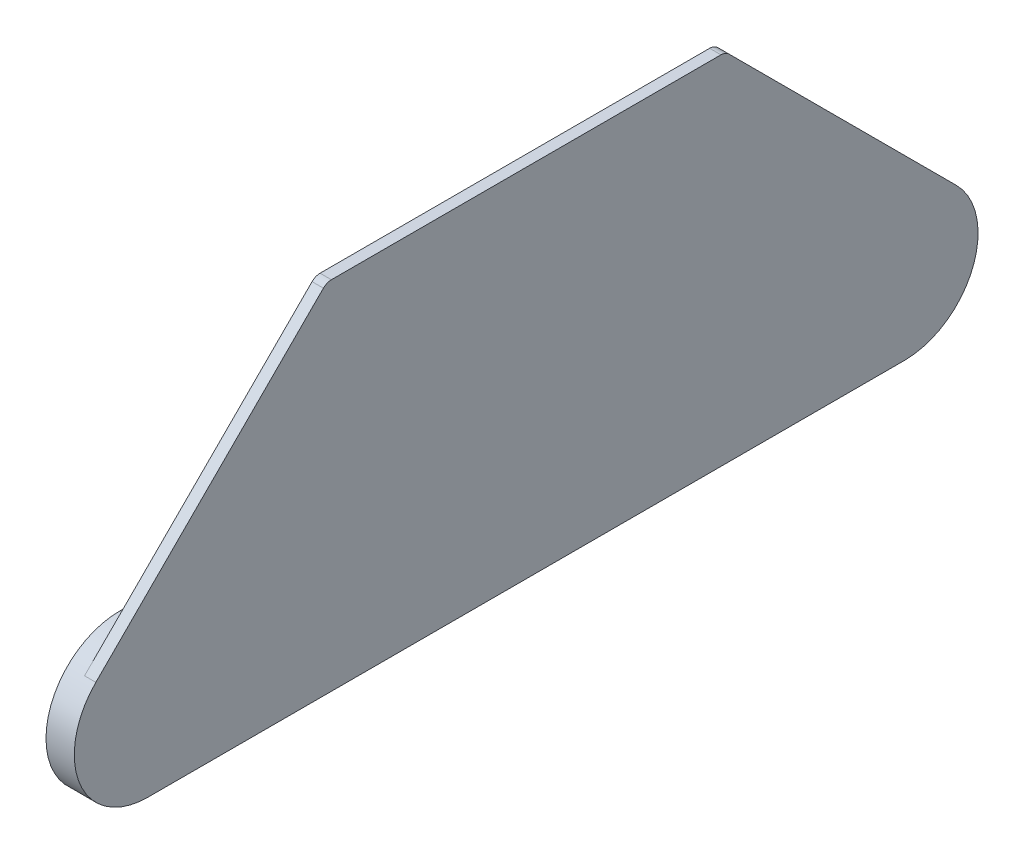
ISO-10303-21;
HEADER;
FILE_DESCRIPTION(('STEP AP214'),'2;1');
FILE_NAME('part.step','',(''),(''),'','','');
FILE_SCHEMA(('AUTOMOTIVE_DESIGN { 1 0 10303 214 1 1 1 1 }'));
ENDSEC;
DATA;
#1=APPLICATION_CONTEXT('core data for automotive mechanical design processes');
#2=APPLICATION_PROTOCOL_DEFINITION('international standard','automotive_design',2000,#1);
#3=PRODUCT_CONTEXT('',#1,'mechanical');
#4=PRODUCT('Part','Part','',(#3));
#5=PRODUCT_RELATED_PRODUCT_CATEGORY('part','',(#4));
#6=PRODUCT_DEFINITION_FORMATION('','',#4);
#7=PRODUCT_DEFINITION_CONTEXT('part definition',#1,'design');
#8=PRODUCT_DEFINITION('design','',#6,#7);
#9=PRODUCT_DEFINITION_SHAPE('','',#8);
#10=(LENGTH_UNIT() NAMED_UNIT(*) SI_UNIT(.MILLI.,.METRE.));
#11=(NAMED_UNIT(*) PLANE_ANGLE_UNIT() SI_UNIT($,.RADIAN.));
#12=(NAMED_UNIT(*) SI_UNIT($,.STERADIAN.) SOLID_ANGLE_UNIT());
#13=UNCERTAINTY_MEASURE_WITH_UNIT(LENGTH_MEASURE(1.E-05),#10,'distance_accuracy_value','');
#14=(GEOMETRIC_REPRESENTATION_CONTEXT(3) GLOBAL_UNCERTAINTY_ASSIGNED_CONTEXT((#13)) GLOBAL_UNIT_ASSIGNED_CONTEXT((#10,
#11,#12)) REPRESENTATION_CONTEXT('',''));
#15=CARTESIAN_POINT('',(0.,0.,0.));
#16=DIRECTION('',(0.,0.,1.));
#17=DIRECTION('',(1.,0.,0.));
#18=AXIS2_PLACEMENT_3D('',#15,#16,#17);
#19=CARTESIAN_POINT('',(-2.54,0.,0.));
#20=DIRECTION('',(1.,0.,0.));
#21=DIRECTION('',(0.,0.,-1.));
#22=AXIS2_PLACEMENT_3D('',#19,#20,#21);
#23=PLANE('',#22);
#24=DIRECTION('',(0.,0.,-1.));
#25=VECTOR('',#24,1.);
#26=CARTESIAN_POINT('',(-2.54,16.51,0.));
#27=LINE('',#26,#25);
#28=CARTESIAN_POINT('',(-2.54,16.51,56.842949223809));
#29=VERTEX_POINT('',#28);
#30=CARTESIAN_POINT('',(-2.54,16.51,1.30680579649923));
#31=VERTEX_POINT('',#30);
#32=EDGE_CURVE('E437',#29,#31,#27,.T.);
#33=ORIENTED_EDGE('',*,*,#32,.F.);
#34=DIRECTION('',(0.,0.554700196225229,-0.832050294337844));
#35=VECTOR('',#34,1.);
#36=CARTESIAN_POINT('',(-2.54,37.6652073340657,25.1101382227105));
#37=LINE('',#36,#35);
#38=CARTESIAN_POINT('',(-2.54,41.5512997013233,19.2809996718241));
#39=VERTEX_POINT('',#38);
#40=EDGE_CURVE('E414',#29,#39,#37,.T.);
#41=ORIENTED_EDGE('',*,*,#40,.T.);
#42=DIRECTION('',(0.,0.554700196225229,0.832050294337844));
#43=VECTOR('',#42,1.);
#44=CARTESIAN_POINT('',(-2.54,19.8673614831511,-13.2449076554341));
#45=LINE('',#44,#43);
#46=CARTESIAN_POINT('',(-2.54,29.6365922523819,1.40893849841209));
#47=VERTEX_POINT('',#46);
#48=EDGE_CURVE('E460',#47,#39,#45,.T.);
#49=ORIENTED_EDGE('',*,*,#48,.F.);
#50=CARTESIAN_POINT('',(-2.54,31.75,0.));
#51=DIRECTION('',(1.,0.,0.));
#52=DIRECTION('',(0.,0.,-1.));
#53=AXIS2_PLACEMENT_3D('',#50,#51,#52);
#54=CIRCLE('',#53,2.54);
#55=CARTESIAN_POINT('',(-2.54,29.5719599153744,1.30680579649925));
#56=VERTEX_POINT('',#55);
#57=EDGE_CURVE('E459',#47,#56,#54,.T.);
#58=ORIENTED_EDGE('',*,*,#57,.T.);
#59=DIRECTION('',(0.,-1.,0.));
#60=VECTOR('',#59,1.);
#61=CARTESIAN_POINT('',(-2.54,0.,1.30680579649925));
#62=LINE('',#61,#60);
#63=EDGE_CURVE('E373',#56,#31,#62,.T.);
#64=ORIENTED_EDGE('',*,*,#63,.T.);
#65=EDGE_LOOP('',(#33,#41,#49,#58,#64));
#66=FACE_BOUND('',#65,.T.);
#67=ADVANCED_FACE('F47',(#66),#23,.F.);
#68=CARTESIAN_POINT('',(-6.35,16.51,84.9253895647883));
#69=DIRECTION('',(0.,-1.,0.));
#70=DIRECTION('',(0.,0.,-1.));
#71=AXIS2_PLACEMENT_3D('',#68,#69,#70);
#72=PLANE('',#71);
#73=DIRECTION('',(0.95300940526024,0.,0.30294070952172));
#74=VECTOR('',#73,1.);
#75=CARTESIAN_POINT('',(0.746897105379903,16.51,62.5995367592369));
#76=LINE('',#75,#74);
#77=CARTESIAN_POINT('',(-6.35,16.51,60.3435894069447));
#78=VERTEX_POINT('',#77);
#79=CARTESIAN_POINT('',(-2.54,16.51,61.5547045301606));
#80=VERTEX_POINT('',#79);
#81=EDGE_CURVE('E241',#78,#80,#76,.T.);
#82=ORIENTED_EDGE('',*,*,#81,.F.);
#83=DIRECTION('',(0.,0.,-1.));
#84=VECTOR('',#83,1.);
#85=CARTESIAN_POINT('',(-6.35,16.51,84.9253895647883));
#86=LINE('',#85,#84);
#87=CARTESIAN_POINT('',(-6.35,16.51,84.9253895647883));
#88=VERTEX_POINT('',#87);
#89=EDGE_CURVE('E254',#88,#78,#86,.T.);
#90=ORIENTED_EDGE('',*,*,#89,.F.);
#91=DIRECTION('',(1.,0.,0.));
#92=VECTOR('',#91,1.);
#93=CARTESIAN_POINT('',(-6.35,16.51,84.9253895647883));
#94=LINE('',#93,#92);
#95=CARTESIAN_POINT('',(-2.54,16.51,84.9253895647883));
#96=VERTEX_POINT('',#95);
#97=EDGE_CURVE('E286',#88,#96,#94,.T.);
#98=ORIENTED_EDGE('',*,*,#97,.T.);
#99=EDGE_CURVE('E257',#96,#80,#27,.T.);
#100=ORIENTED_EDGE('',*,*,#99,.T.);
#101=EDGE_LOOP('',(#82,#90,#98,#100));
#102=FACE_BOUND('',#101,.T.);
#103=ADVANCED_FACE('F252',(#102),#72,.F.);
#104=CARTESIAN_POINT('',(-6.35,19.8673614831511,-13.2449076554341));
#105=DIRECTION('',(0.,0.832050294337844,-0.554700196225229));
#106=DIRECTION('',(0.,0.554700196225229,0.832050294337844));
#107=AXIS2_PLACEMENT_3D('',#104,#105,#106);
#108=PLANE('',#107);
#109=DIRECTION('',(-0.982240087996689,-0.104077500017655,-0.156116250026482));
#110=VECTOR('',#109,1.);
#111=CARTESIAN_POINT('',(-13.9420598710757,41.9137301975197,19.8246454161189));
#112=LINE('',#111,#110);
#113=CARTESIAN_POINT('',(-2.54,43.1218848034405,21.636877325));
#114=VERTEX_POINT('',#113);
#115=CARTESIAN_POINT('',(-6.35,42.7181797623685,21.0313197633919));
#116=VERTEX_POINT('',#115);
#117=EDGE_CURVE('E244',#114,#116,#112,.T.);
#118=ORIENTED_EDGE('',*,*,#117,.F.);
#119=CARTESIAN_POINT('',(-2.54,55.0365922523818,39.508938498412));
#120=VERTEX_POINT('',#119);
#121=EDGE_CURVE('E467',#114,#120,#45,.T.);
#122=ORIENTED_EDGE('',*,*,#121,.T.);
#123=DIRECTION('',(1.,0.,0.));
#124=VECTOR('',#123,1.);
#125=CARTESIAN_POINT('',(-6.35,55.0365922523818,39.508938498412));
#126=LINE('',#125,#124);
#127=CARTESIAN_POINT('',(-6.35,55.0365922523818,39.508938498412));
#128=VERTEX_POINT('',#127);
#129=EDGE_CURVE('E293',#128,#120,#126,.T.);
#130=ORIENTED_EDGE('',*,*,#129,.F.);
#131=DIRECTION('',(0.,0.554700196225229,0.832050294337844));
#132=VECTOR('',#131,1.);
#133=CARTESIAN_POINT('',(-6.35,19.8673614831511,-13.2449076554341));
#134=LINE('',#133,#132);
#135=EDGE_CURVE('E337',#116,#128,#134,.T.);
#136=ORIENTED_EDGE('',*,*,#135,.F.);
#137=EDGE_LOOP('',(#118,#122,#130,#136));
#138=FACE_BOUND('',#137,.T.);
#139=ADVANCED_FACE('F584',(#138),#108,.F.);
#140=DIRECTION('',(0.,-1.,0.));
#141=VECTOR('',#140,1.);
#142=CARTESIAN_POINT('',(-2.54,0.,-1.30680579649925));
#143=LINE('',#142,#141);
#144=CARTESIAN_POINT('',(-2.54,29.5719599153744,-1.30680579649925));
#145=VERTEX_POINT('',#144);
#146=CARTESIAN_POINT('',(-2.54,16.51,-1.30680579649925));
#147=VERTEX_POINT('',#146);
#148=EDGE_CURVE('E383',#145,#147,#143,.T.);
#149=ORIENTED_EDGE('',*,*,#148,.F.);
#150=CARTESIAN_POINT('',(-2.54,29.6365922523819,-1.40893849841209));
#151=VERTEX_POINT('',#150);
#152=EDGE_CURVE('E452',#145,#151,#54,.T.);
#153=ORIENTED_EDGE('',*,*,#152,.T.);
#154=DIRECTION('',(0.,-0.554700196225229,0.832050294337844));
#155=VECTOR('',#154,1.);
#156=CARTESIAN_POINT('',(-2.54,19.8673614831511,13.2449076554341));
#157=LINE('',#156,#155);
#158=CARTESIAN_POINT('',(-2.54,41.5512997013232,-19.2809996718241));
#159=VERTEX_POINT('',#158);
#160=EDGE_CURVE('E465',#159,#151,#157,.T.);
#161=ORIENTED_EDGE('',*,*,#160,.F.);
#162=DIRECTION('',(0.,-0.554700196225229,-0.832050294337844));
#163=VECTOR('',#162,1.);
#164=CARTESIAN_POINT('',(-2.54,37.6652073340657,-25.1101382227105));
#165=LINE('',#164,#163);
#166=CARTESIAN_POINT('',(-2.54,16.51,-56.842949223809));
#167=VERTEX_POINT('',#166);
#168=EDGE_CURVE('E345',#159,#167,#165,.T.);
#169=ORIENTED_EDGE('',*,*,#168,.T.);
#170=EDGE_CURVE('E454',#147,#167,#27,.T.);
#171=ORIENTED_EDGE('',*,*,#170,.F.);
#172=EDGE_LOOP('',(#149,#153,#161,#169,#171));
#173=FACE_BOUND('',#172,.T.);
#174=ADVANCED_FACE('F450',(#173),#23,.F.);
#175=DIRECTION('',(-0.984807753012208,0.,0.173648177666931));
#176=VECTOR('',#175,1.);
#177=CARTESIAN_POINT('',(-20.9816883509745,16.51,1.94496142959456));
#178=LINE('',#177,#176);
#179=CARTESIAN_POINT('',(-6.35,16.51,-0.634999999999997));
#180=VERTEX_POINT('',#179);
#181=EDGE_CURVE('E73',#147,#180,#178,.T.);
#182=ORIENTED_EDGE('',*,*,#181,.F.);
#183=ORIENTED_EDGE('',*,*,#170,.T.);
#184=DIRECTION('',(-0.95300940526024,0.,-0.30294070952172));
#185=VECTOR('',#184,1.);
#186=CARTESIAN_POINT('',(34.9289326282017,16.51,-44.9324004162562));
#187=LINE('',#186,#185);
#188=CARTESIAN_POINT('',(-6.35,16.51,-58.054064347025));
#189=VERTEX_POINT('',#188);
#190=EDGE_CURVE('E291',#167,#189,#187,.T.);
#191=ORIENTED_EDGE('',*,*,#190,.T.);
#192=EDGE_CURVE('E274',#180,#189,#86,.T.);
#193=ORIENTED_EDGE('',*,*,#192,.F.);
#194=EDGE_LOOP('',(#182,#183,#191,#193));
#195=FACE_BOUND('',#194,.T.);
#196=ADVANCED_FACE('F586',(#195),#72,.F.);
#197=CARTESIAN_POINT('',(-6.35,31.75,0.));
#198=DIRECTION('',(1.,0.,0.));
#199=DIRECTION('',(0.,0.,-1.));
#200=AXIS2_PLACEMENT_3D('',#197,#198,#199);
#201=CYLINDRICAL_SURFACE('',#200,2.54);
#202=ORIENTED_EDGE('',*,*,#152,.F.);
#203=CARTESIAN_POINT('',(-9.95126395545724,31.75,0.));
#204=DIRECTION('',(0.173648177666931,0.,0.984807753012208));
#205=DIRECTION('',(0.984807753012208,0.,-0.173648177666931));
#206=AXIS2_PLACEMENT_3D('',#203,#204,#205);
#207=ELLIPSE('',#206,14.6272770271848,2.54);
#208=CARTESIAN_POINT('',(-6.35,29.2906555751583,-0.635));
#209=VERTEX_POINT('',#208);
#210=EDGE_CURVE('E387',#145,#209,#207,.F.);
#211=ORIENTED_EDGE('',*,*,#210,.T.);
#212=CARTESIAN_POINT('',(-6.35,31.75,0.));
#213=DIRECTION('',(1.,0.,0.));
#214=DIRECTION('',(0.,0.,-1.));
#215=AXIS2_PLACEMENT_3D('',#212,#213,#214);
#216=CIRCLE('',#215,2.54);
#217=CARTESIAN_POINT('',(-6.35,29.6365922523819,-1.40893849841209));
#218=VERTEX_POINT('',#217);
#219=EDGE_CURVE('E332',#209,#218,#216,.T.);
#220=ORIENTED_EDGE('',*,*,#219,.T.);
#221=DIRECTION('',(1.,0.,0.));
#222=VECTOR('',#221,1.);
#223=CARTESIAN_POINT('',(-6.35,29.6365922523819,-1.40893849841209));
#224=LINE('',#223,#222);
#225=EDGE_CURVE('E302',#218,#151,#224,.T.);
#226=ORIENTED_EDGE('',*,*,#225,.T.);
#227=EDGE_LOOP('',(#202,#211,#220,#226));
#228=FACE_BOUND('',#227,.T.);
#229=ADVANCED_FACE('F456',(#228),#201,.T.);
#230=DIRECTION('',(-0.95300940526024,0.,0.30294070952172));
#231=VECTOR('',#230,1.);
#232=CARTESIAN_POINT('',(-48.2899307514516,16.51,-47.0118087246049));
#233=LINE('',#232,#231);
#234=CARTESIAN_POINT('',(-2.54,16.51,-61.5547045301606));
#235=VERTEX_POINT('',#234);
#236=CARTESIAN_POINT('',(-6.35,16.51,-60.3435894069446));
#237=VERTEX_POINT('',#236);
#238=EDGE_CURVE('E353',#235,#237,#233,.T.);
#239=ORIENTED_EDGE('',*,*,#238,.F.);
#240=CARTESIAN_POINT('',(-2.54,16.51,-84.9253895647883));
#241=VERTEX_POINT('',#240);
#242=EDGE_CURVE('E623',#235,#241,#27,.T.);
#243=ORIENTED_EDGE('',*,*,#242,.T.);
#244=DIRECTION('',(1.,0.,0.));
#245=VECTOR('',#244,1.);
#246=CARTESIAN_POINT('',(-6.35,16.51,-84.9253895647883));
#247=LINE('',#246,#245);
#248=CARTESIAN_POINT('',(-6.35,16.51,-84.9253895647883));
#249=VERTEX_POINT('',#248);
#250=EDGE_CURVE('E278',#249,#241,#247,.T.);
#251=ORIENTED_EDGE('',*,*,#250,.F.);
#252=EDGE_CURVE('E269',#237,#249,#86,.T.);
#253=ORIENTED_EDGE('',*,*,#252,.F.);
#254=EDGE_LOOP('',(#239,#243,#251,#253));
#255=FACE_BOUND('',#254,.T.);
#256=ADVANCED_FACE('F597',(#255),#72,.F.);
#257=CARTESIAN_POINT('',(-6.35,19.8673614831511,13.2449076554341));
#258=DIRECTION('',(0.,0.832050294337844,0.554700196225229));
#259=DIRECTION('',(0.,-0.554700196225229,0.832050294337844));
#260=AXIS2_PLACEMENT_3D('',#257,#258,#259);
#261=PLANE('',#260);
#262=DIRECTION('',(0.982240087996689,0.104077500017655,-0.156116250026482));
#263=VECTOR('',#262,1.);
#264=CARTESIAN_POINT('',(-13.9420598710757,41.9137301975197,-19.8246454161189));
#265=LINE('',#264,#263);
#266=CARTESIAN_POINT('',(-6.35,42.7181797623685,-21.031319763392));
#267=VERTEX_POINT('',#266);
#268=CARTESIAN_POINT('',(-2.54,43.1218848034404,-21.6368773249999));
#269=VERTEX_POINT('',#268);
#270=EDGE_CURVE('E359',#267,#269,#265,.T.);
#271=ORIENTED_EDGE('',*,*,#270,.F.);
#272=DIRECTION('',(0.,-0.554700196225229,0.832050294337844));
#273=VECTOR('',#272,1.);
#274=CARTESIAN_POINT('',(-6.35,19.8673614831511,13.2449076554341));
#275=LINE('',#274,#273);
#276=CARTESIAN_POINT('',(-6.35,55.0365922523818,-39.508938498412));
#277=VERTEX_POINT('',#276);
#278=EDGE_CURVE('E324',#277,#267,#275,.T.);
#279=ORIENTED_EDGE('',*,*,#278,.F.);
#280=DIRECTION('',(1.,0.,0.));
#281=VECTOR('',#280,1.);
#282=CARTESIAN_POINT('',(-6.35,55.0365922523818,-39.508938498412));
#283=LINE('',#282,#281);
#284=CARTESIAN_POINT('',(-2.54,55.0365922523818,-39.508938498412));
#285=VERTEX_POINT('',#284);
#286=EDGE_CURVE('E306',#277,#285,#283,.T.);
#287=ORIENTED_EDGE('',*,*,#286,.T.);
#288=EDGE_CURVE('E471',#285,#269,#157,.T.);
#289=ORIENTED_EDGE('',*,*,#288,.T.);
#290=EDGE_LOOP('',(#271,#279,#287,#289));
#291=FACE_BOUND('',#290,.T.);
#292=ADVANCED_FACE('F589',(#291),#261,.F.);
#293=CARTESIAN_POINT('',(-2.54,57.15,-38.1));
#294=DIRECTION('',(1.,0.,0.));
#295=DIRECTION('',(0.,0.,-1.));
#296=AXIS2_PLACEMENT_3D('',#293,#294,#295);
#297=CIRCLE('',#296,2.54);
#298=CARTESIAN_POINT('',(-2.54,59.69,-38.0999999999999));
#299=VERTEX_POINT('',#298);
#300=EDGE_CURVE('E475',#299,#285,#297,.F.);
#301=ORIENTED_EDGE('',*,*,#300,.F.);
#302=DIRECTION('',(0.,0.,-1.));
#303=VECTOR('',#302,1.);
#304=CARTESIAN_POINT('',(-2.54,59.69,0.));
#305=LINE('',#304,#303);
#306=CARTESIAN_POINT('',(-2.54,59.69,38.0999999999999));
#307=VERTEX_POINT('',#306);
#308=EDGE_CURVE('E479',#307,#299,#305,.T.);
#309=ORIENTED_EDGE('',*,*,#308,.F.);
#310=CARTESIAN_POINT('',(-2.54,57.15,38.1));
#311=DIRECTION('',(1.,0.,0.));
#312=DIRECTION('',(0.,0.,-1.));
#313=AXIS2_PLACEMENT_3D('',#310,#311,#312);
#314=CIRCLE('',#313,2.54);
#315=EDGE_CURVE('E482',#120,#307,#314,.F.);
#316=ORIENTED_EDGE('',*,*,#315,.F.);
#317=ORIENTED_EDGE('',*,*,#121,.F.);
#318=DIRECTION('',(0.,0.554700196225229,-0.832050294337844));
#319=VECTOR('',#318,1.);
#320=CARTESIAN_POINT('',(-2.54,39.8398636293049,26.5599090862033));
#321=LINE('',#320,#319);
#322=EDGE_CURVE('E260',#80,#114,#321,.T.);
#323=ORIENTED_EDGE('',*,*,#322,.F.);
#324=ORIENTED_EDGE('',*,*,#99,.F.);
#325=CARTESIAN_POINT('',(-2.54,0.,84.9253895647883));
#326=DIRECTION('',(1.,0.,0.));
#327=DIRECTION('',(0.,0.,-1.));
#328=AXIS2_PLACEMENT_3D('',#325,#326,#327);
#329=CIRCLE('',#328,16.51);
#330=CARTESIAN_POINT('',(-2.54,11.6743329573899,96.5997225221782));
#331=VERTEX_POINT('',#330);
#332=EDGE_CURVE('E619',#96,#331,#329,.T.);
#333=ORIENTED_EDGE('',*,*,#332,.T.);
#334=DIRECTION('',(0.,0.707106781186549,-0.707106781186546));
#335=VECTOR('',#334,1.);
#336=CARTESIAN_POINT('',(-2.54,54.137027739784,54.1370277397842));
#337=LINE('',#336,#335);
#338=CARTESIAN_POINT('',(-2.54,62.7560512242138,45.5180042553545));
#339=VERTEX_POINT('',#338);
#340=EDGE_CURVE('E487',#331,#339,#337,.T.);
#341=ORIENTED_EDGE('',*,*,#340,.T.);
#342=CARTESIAN_POINT('',(-2.54,60.96,43.7219530311406));
#343=DIRECTION('',(1.,0.,0.));
#344=DIRECTION('',(0.,0.,-1.));
#345=AXIS2_PLACEMENT_3D('',#342,#343,#344);
#346=CIRCLE('',#345,2.54);
#347=CARTESIAN_POINT('',(-2.54,63.5,43.7219530311406));
#348=VERTEX_POINT('',#347);
#349=EDGE_CURVE('E502',#339,#348,#346,.F.);
#350=ORIENTED_EDGE('',*,*,#349,.T.);
#351=DIRECTION('',(0.,0.,-1.));
#352=VECTOR('',#351,1.);
#353=CARTESIAN_POINT('',(-2.54,63.5,0.));
#354=LINE('',#353,#352);
#355=CARTESIAN_POINT('',(-2.54,63.5,-43.7219530311406));
#356=VERTEX_POINT('',#355);
#357=EDGE_CURVE('E499',#348,#356,#354,.T.);
#358=ORIENTED_EDGE('',*,*,#357,.T.);
#359=CARTESIAN_POINT('',(-2.54,60.96,-43.7219530311406));
#360=DIRECTION('',(1.,0.,0.));
#361=DIRECTION('',(0.,0.,-1.));
#362=AXIS2_PLACEMENT_3D('',#359,#360,#361);
#363=CIRCLE('',#362,2.54);
#364=CARTESIAN_POINT('',(-2.54,62.7560512242138,-45.5180042553545));
#365=VERTEX_POINT('',#364);
#366=EDGE_CURVE('E496',#356,#365,#363,.F.);
#367=ORIENTED_EDGE('',*,*,#366,.T.);
#368=DIRECTION('',(0.,-0.707106781186549,-0.707106781186546));
#369=VECTOR('',#368,1.);
#370=CARTESIAN_POINT('',(-2.54,54.1370277397841,-54.1370277397842));
#371=LINE('',#370,#369);
#372=CARTESIAN_POINT('',(-2.54,11.6743329573899,-96.5997225221782));
#373=VERTEX_POINT('',#372);
#374=EDGE_CURVE('E491',#365,#373,#371,.T.);
#375=ORIENTED_EDGE('',*,*,#374,.T.);
#376=CARTESIAN_POINT('',(-2.54,0.,-84.9253895647883));
#377=DIRECTION('',(1.,0.,0.));
#378=DIRECTION('',(0.,0.,-1.));
#379=AXIS2_PLACEMENT_3D('',#376,#377,#378);
#380=CIRCLE('',#379,16.51);
#381=EDGE_CURVE('E318',#373,#241,#380,.T.);
#382=ORIENTED_EDGE('',*,*,#381,.T.);
#383=ORIENTED_EDGE('',*,*,#242,.F.);
#384=DIRECTION('',(0.,-0.554700196225229,-0.832050294337844));
#385=VECTOR('',#384,1.);
#386=CARTESIAN_POINT('',(-2.54,39.8398636293049,-26.5599090862033));
#387=LINE('',#386,#385);
#388=EDGE_CURVE('E356',#269,#235,#387,.T.);
#389=ORIENTED_EDGE('',*,*,#388,.F.);
#390=ORIENTED_EDGE('',*,*,#288,.F.);
#391=EDGE_LOOP('',(#301,#309,#316,#317,#323,#324,#333,#341,#350,#358,#367,#375,#382,#383,#389,#390));
#392=FACE_BOUND('',#391,.T.);
#393=ADVANCED_FACE('F579',(#392),#23,.F.);
#394=CARTESIAN_POINT('',(-2.54,54.137027739784,54.1370277397842));
#395=DIRECTION('',(0.,-0.707106781186546,-0.707106781186549));
#396=DIRECTION('',(0.,0.707106781186549,-0.707106781186546));
#397=AXIS2_PLACEMENT_3D('',#394,#395,#396);
#398=PLANE('',#397);
#399=DIRECTION('',(0.,0.707106781186549,-0.707106781186546));
#400=VECTOR('',#399,1.);
#401=CARTESIAN_POINT('',(0.,54.137027739784,54.1370277397842));
#402=LINE('',#401,#400);
#403=CARTESIAN_POINT('',(0.,11.6743329573899,96.5997225221782));
#404=VERTEX_POINT('',#403);
#405=CARTESIAN_POINT('',(0.,62.7560512242138,45.5180042553545));
#406=VERTEX_POINT('',#405);
#407=EDGE_CURVE('E486',#404,#406,#402,.T.);
#408=ORIENTED_EDGE('',*,*,#407,.T.);
#409=DIRECTION('',(1.,0.,0.));
#410=VECTOR('',#409,1.);
#411=CARTESIAN_POINT('',(-2.54,62.7560512242138,45.5180042553545));
#412=LINE('',#411,#410);
#413=EDGE_CURVE('E11',#339,#406,#412,.T.);
#414=ORIENTED_EDGE('',*,*,#413,.F.);
#415=ORIENTED_EDGE('',*,*,#340,.F.);
#416=DIRECTION('',(1.,0.,0.));
#417=VECTOR('',#416,1.);
#418=CARTESIAN_POINT('',(-2.54,11.6743329573899,96.5997225221782));
#419=LINE('',#418,#417);
#420=EDGE_CURVE('E51',#331,#404,#419,.T.);
#421=ORIENTED_EDGE('',*,*,#420,.T.);
#422=EDGE_LOOP('',(#408,#414,#415,#421));
#423=FACE_BOUND('',#422,.T.);
#424=ADVANCED_FACE('F49',(#423),#398,.F.);
#425=CARTESIAN_POINT('',(-2.54,60.96,43.7219530311406));
#426=DIRECTION('',(1.,0.,0.));
#427=DIRECTION('',(0.,0.,-1.));
#428=AXIS2_PLACEMENT_3D('',#425,#426,#427);
#429=CYLINDRICAL_SURFACE('',#428,2.54);
#430=CARTESIAN_POINT('',(0.,60.96,43.7219530311406));
#431=DIRECTION('',(1.,0.,0.));
#432=DIRECTION('',(0.,0.,-1.));
#433=AXIS2_PLACEMENT_3D('',#430,#431,#432);
#434=CIRCLE('',#433,2.54);
#435=CARTESIAN_POINT('',(0.,63.5,43.7219530311406));
#436=VERTEX_POINT('',#435);
#437=EDGE_CURVE('E492',#406,#436,#434,.F.);
#438=ORIENTED_EDGE('',*,*,#437,.T.);
#439=DIRECTION('',(1.,0.,0.));
#440=VECTOR('',#439,1.);
#441=CARTESIAN_POINT('',(-2.54,63.5,43.7219530311406));
#442=LINE('',#441,#440);
#443=EDGE_CURVE('E57',#348,#436,#442,.T.);
#444=ORIENTED_EDGE('',*,*,#443,.F.);
#445=ORIENTED_EDGE('',*,*,#349,.F.);
#446=ORIENTED_EDGE('',*,*,#413,.T.);
#447=EDGE_LOOP('',(#438,#444,#445,#446));
#448=FACE_BOUND('',#447,.T.);
#449=ADVANCED_FACE('F595',(#448),#429,.T.);
#450=CARTESIAN_POINT('',(-2.54,63.5,0.));
#451=DIRECTION('',(0.,-1.,0.));
#452=DIRECTION('',(0.,0.,-1.));
#453=AXIS2_PLACEMENT_3D('',#450,#451,#452);
#454=PLANE('',#453);
#455=DIRECTION('',(1.,0.,0.));
#456=VECTOR('',#455,1.);
#457=CARTESIAN_POINT('',(-2.54,63.5,-43.7219530311406));
#458=LINE('',#457,#456);
#459=CARTESIAN_POINT('',(0.,63.5,-43.7219530311406));
#460=VERTEX_POINT('',#459);
#461=EDGE_CURVE('E532',#356,#460,#458,.T.);
#462=ORIENTED_EDGE('',*,*,#461,.F.);
#463=ORIENTED_EDGE('',*,*,#357,.F.);
#464=ORIENTED_EDGE('',*,*,#443,.T.);
#465=DIRECTION('',(0.,0.,-1.));
#466=VECTOR('',#465,1.);
#467=CARTESIAN_POINT('',(0.,63.5,0.));
#468=LINE('',#467,#466);
#469=EDGE_CURVE('E524',#436,#460,#468,.T.);
#470=ORIENTED_EDGE('',*,*,#469,.T.);
#471=EDGE_LOOP('',(#462,#463,#464,#470));
#472=FACE_BOUND('',#471,.T.);
#473=ADVANCED_FACE('F644',(#472),#454,.F.);
#474=CARTESIAN_POINT('',(-2.54,60.96,-43.7219530311406));
#475=DIRECTION('',(1.,0.,0.));
#476=DIRECTION('',(0.,0.,-1.));
#477=AXIS2_PLACEMENT_3D('',#474,#475,#476);
#478=CYLINDRICAL_SURFACE('',#477,2.54);
#479=CARTESIAN_POINT('',(0.,60.96,-43.7219530311406));
#480=DIRECTION('',(1.,0.,0.));
#481=DIRECTION('',(0.,0.,-1.));
#482=AXIS2_PLACEMENT_3D('',#479,#480,#481);
#483=CIRCLE('',#482,2.54);
#484=CARTESIAN_POINT('',(0.,62.7560512242138,-45.5180042553545));
#485=VERTEX_POINT('',#484);
#486=EDGE_CURVE('E521',#460,#485,#483,.F.);
#487=ORIENTED_EDGE('',*,*,#486,.T.);
#488=DIRECTION('',(1.,0.,0.));
#489=VECTOR('',#488,1.);
#490=CARTESIAN_POINT('',(-2.54,62.7560512242138,-45.5180042553545));
#491=LINE('',#490,#489);
#492=EDGE_CURVE('E536',#365,#485,#491,.T.);
#493=ORIENTED_EDGE('',*,*,#492,.F.);
#494=ORIENTED_EDGE('',*,*,#366,.F.);
#495=ORIENTED_EDGE('',*,*,#461,.T.);
#496=EDGE_LOOP('',(#487,#493,#494,#495));
#497=FACE_BOUND('',#496,.T.);
#498=ADVANCED_FACE('F640',(#497),#478,.T.);
#499=CARTESIAN_POINT('',(-2.54,54.1370277397841,-54.1370277397842));
#500=DIRECTION('',(0.,-0.707106781186546,0.707106781186549));
#501=DIRECTION('',(0.,-0.707106781186549,-0.707106781186546));
#502=AXIS2_PLACEMENT_3D('',#499,#500,#501);
#503=PLANE('',#502);
#504=DIRECTION('',(0.,-0.707106781186549,-0.707106781186546));
#505=VECTOR('',#504,1.);
#506=CARTESIAN_POINT('',(0.,54.1370277397841,-54.1370277397842));
#507=LINE('',#506,#505);
#508=CARTESIAN_POINT('',(0.,11.6743329573899,-96.5997225221782));
#509=VERTEX_POINT('',#508);
#510=EDGE_CURVE('E517',#485,#509,#507,.T.);
#511=ORIENTED_EDGE('',*,*,#510,.T.);
#512=DIRECTION('',(1.,0.,0.));
#513=VECTOR('',#512,1.);
#514=CARTESIAN_POINT('',(-2.54,11.6743329573899,-96.5997225221782));
#515=LINE('',#514,#513);
#516=EDGE_CURVE('E540',#373,#509,#515,.T.);
#517=ORIENTED_EDGE('',*,*,#516,.F.);
#518=ORIENTED_EDGE('',*,*,#374,.F.);
#519=ORIENTED_EDGE('',*,*,#492,.T.);
#520=EDGE_LOOP('',(#511,#517,#518,#519));
#521=FACE_BOUND('',#520,.T.);
#522=ADVANCED_FACE('F635',(#521),#503,.F.);
#523=CARTESIAN_POINT('',(-2.54,0.,-84.9253895647883));
#524=DIRECTION('',(1.,0.,0.));
#525=DIRECTION('',(0.,0.,-1.));
#526=AXIS2_PLACEMENT_3D('',#523,#524,#525);
#527=CYLINDRICAL_SURFACE('',#526,16.51);
#528=CARTESIAN_POINT('',(-6.35,0.,-84.9253895647883));
#529=DIRECTION('',(1.,0.,0.));
#530=DIRECTION('',(0.,0.,-1.));
#531=AXIS2_PLACEMENT_3D('',#528,#529,#530);
#532=CIRCLE('',#531,16.51);
#533=CARTESIAN_POINT('',(-6.35,-16.51,-84.9253895647883));
#534=VERTEX_POINT('',#533);
#535=EDGE_CURVE('E266',#534,#249,#532,.T.);
#536=ORIENTED_EDGE('',*,*,#535,.T.);
#537=ORIENTED_EDGE('',*,*,#250,.T.);
#538=ORIENTED_EDGE('',*,*,#381,.F.);
#539=ORIENTED_EDGE('',*,*,#516,.T.);
#540=CARTESIAN_POINT('',(0.,0.,-84.9253895647883));
#541=DIRECTION('',(1.,0.,0.));
#542=DIRECTION('',(0.,0.,-1.));
#543=AXIS2_PLACEMENT_3D('',#540,#541,#542);
#544=CIRCLE('',#543,16.51);
#545=CARTESIAN_POINT('',(0.,-16.51,-84.9253895647883));
#546=VERTEX_POINT('',#545);
#547=EDGE_CURVE('E514',#546,#509,#544,.T.);
#548=ORIENTED_EDGE('',*,*,#547,.F.);
#549=DIRECTION('',(1.,0.,0.));
#550=VECTOR('',#549,1.);
#551=CARTESIAN_POINT('',(-2.54,-16.51,-84.9253895647883));
#552=LINE('',#551,#550);
#553=EDGE_CURVE('E544',#534,#546,#552,.T.);
#554=ORIENTED_EDGE('',*,*,#553,.F.);
#555=EDGE_LOOP('',(#536,#537,#538,#539,#548,#554));
#556=FACE_BOUND('',#555,.T.);
#557=ADVANCED_FACE('F573',(#556),#527,.T.);
#558=CARTESIAN_POINT('',(-2.54,-16.51,0.));
#559=DIRECTION('',(0.,-1.,0.));
#560=DIRECTION('',(0.,0.,-1.));
#561=AXIS2_PLACEMENT_3D('',#558,#559,#560);
#562=PLANE('',#561);
#563=DIRECTION('',(0.,0.,-1.));
#564=VECTOR('',#563,1.);
#565=CARTESIAN_POINT('',(-6.35,-16.51,84.9253895647883));
#566=LINE('',#565,#564);
#567=CARTESIAN_POINT('',(-6.35,-16.51,84.9253895647883));
#568=VERTEX_POINT('',#567);
#569=EDGE_CURVE('E272',#568,#534,#566,.T.);
#570=ORIENTED_EDGE('',*,*,#569,.T.);
#571=ORIENTED_EDGE('',*,*,#553,.T.);
#572=DIRECTION('',(0.,0.,-1.));
#573=VECTOR('',#572,1.);
#574=CARTESIAN_POINT('',(0.,-16.51,0.));
#575=LINE('',#574,#573);
#576=CARTESIAN_POINT('',(0.,-16.51,84.9253895647883));
#577=VERTEX_POINT('',#576);
#578=EDGE_CURVE('E511',#577,#546,#575,.T.);
#579=ORIENTED_EDGE('',*,*,#578,.F.);
#580=DIRECTION('',(1.,0.,0.));
#581=VECTOR('',#580,1.);
#582=CARTESIAN_POINT('',(-2.54,-16.51,84.9253895647883));
#583=LINE('',#582,#581);
#584=EDGE_CURVE('E547',#568,#577,#583,.T.);
#585=ORIENTED_EDGE('',*,*,#584,.F.);
#586=EDGE_LOOP('',(#570,#571,#579,#585));
#587=FACE_BOUND('',#586,.T.);
#588=ADVANCED_FACE('F566',(#587),#562,.T.);
#589=CARTESIAN_POINT('',(-2.54,0.,84.9253895647883));
#590=DIRECTION('',(1.,0.,0.));
#591=DIRECTION('',(0.,0.,-1.));
#592=AXIS2_PLACEMENT_3D('',#589,#590,#591);
#593=CYLINDRICAL_SURFACE('',#592,16.51);
#594=ORIENTED_EDGE('',*,*,#584,.T.);
#595=CARTESIAN_POINT('',(0.,0.,84.9253895647883));
#596=DIRECTION('',(1.,0.,0.));
#597=DIRECTION('',(0.,0.,-1.));
#598=AXIS2_PLACEMENT_3D('',#595,#596,#597);
#599=CIRCLE('',#598,16.51);
#600=EDGE_CURVE('E508',#404,#577,#599,.T.);
#601=ORIENTED_EDGE('',*,*,#600,.F.);
#602=ORIENTED_EDGE('',*,*,#420,.F.);
#603=ORIENTED_EDGE('',*,*,#332,.F.);
#604=ORIENTED_EDGE('',*,*,#97,.F.);
#605=CARTESIAN_POINT('',(-6.35,0.,84.9253895647883));
#606=DIRECTION('',(1.,0.,0.));
#607=DIRECTION('',(0.,0.,-1.));
#608=AXIS2_PLACEMENT_3D('',#605,#606,#607);
#609=CIRCLE('',#608,16.51);
#610=EDGE_CURVE('E264',#88,#568,#609,.T.);
#611=ORIENTED_EDGE('',*,*,#610,.T.);
#612=EDGE_LOOP('',(#594,#601,#602,#603,#604,#611));
#613=FACE_BOUND('',#612,.T.);
#614=ADVANCED_FACE('F564',(#613),#593,.T.);
#615=CARTESIAN_POINT('',(0.,0.,0.));
#616=DIRECTION('',(1.,0.,0.));
#617=DIRECTION('',(0.,0.,-1.));
#618=AXIS2_PLACEMENT_3D('',#615,#616,#617);
#619=PLANE('',#618);
#620=ORIENTED_EDGE('',*,*,#486,.F.);
#621=ORIENTED_EDGE('',*,*,#469,.F.);
#622=ORIENTED_EDGE('',*,*,#437,.F.);
#623=ORIENTED_EDGE('',*,*,#407,.F.);
#624=ORIENTED_EDGE('',*,*,#600,.T.);
#625=ORIENTED_EDGE('',*,*,#578,.T.);
#626=ORIENTED_EDGE('',*,*,#547,.T.);
#627=ORIENTED_EDGE('',*,*,#510,.F.);
#628=EDGE_LOOP('',(#620,#621,#622,#623,#624,#625,#626,#627));
#629=FACE_BOUND('',#628,.T.);
#630=ADVANCED_FACE('F562',(#629),#619,.T.);
#631=CARTESIAN_POINT('',(-6.35,16.51,58.0540643470251));
#632=VERTEX_POINT('',#631);
#633=CARTESIAN_POINT('',(-6.35,16.51,0.634999999999997));
#634=VERTEX_POINT('',#633);
#635=EDGE_CURVE('E267',#632,#634,#86,.T.);
#636=ORIENTED_EDGE('',*,*,#635,.F.);
#637=DIRECTION('',(0.95300940526024,0.,-0.30294070952172));
#638=VECTOR('',#637,1.);
#639=CARTESIAN_POINT('',(-14.1078952286298,16.51,60.5201284508882));
#640=LINE('',#639,#638);
#641=EDGE_CURVE('E397',#632,#29,#640,.T.);
#642=ORIENTED_EDGE('',*,*,#641,.T.);
#643=ORIENTED_EDGE('',*,*,#32,.T.);
#644=DIRECTION('',(-0.984807753012208,0.,-0.173648177666931));
#645=VECTOR('',#644,1.);
#646=CARTESIAN_POINT('',(8.0645055599627,16.51,3.17666624379359));
#647=LINE('',#646,#645);
#648=EDGE_CURVE('E366',#31,#634,#647,.T.);
#649=ORIENTED_EDGE('',*,*,#648,.T.);
#650=EDGE_LOOP('',(#636,#642,#643,#649));
#651=FACE_BOUND('',#650,.T.);
#652=ADVANCED_FACE('F434',(#651),#72,.F.);
#653=CARTESIAN_POINT('',(-6.35,57.15,38.1));
#654=DIRECTION('',(1.,0.,0.));
#655=DIRECTION('',(0.,0.,-1.));
#656=AXIS2_PLACEMENT_3D('',#653,#654,#655);
#657=CYLINDRICAL_SURFACE('',#656,2.54);
#658=ORIENTED_EDGE('',*,*,#129,.T.);
#659=ORIENTED_EDGE('',*,*,#315,.T.);
#660=DIRECTION('',(1.,0.,0.));
#661=VECTOR('',#660,1.);
#662=CARTESIAN_POINT('',(-6.35,59.69,38.0999999999999));
#663=LINE('',#662,#661);
#664=CARTESIAN_POINT('',(-6.35,59.69,38.0999999999999));
#665=VERTEX_POINT('',#664);
#666=EDGE_CURVE('E314',#665,#307,#663,.T.);
#667=ORIENTED_EDGE('',*,*,#666,.F.);
#668=CARTESIAN_POINT('',(-6.35,57.15,38.1));
#669=DIRECTION('',(1.,0.,0.));
#670=DIRECTION('',(0.,0.,-1.));
#671=AXIS2_PLACEMENT_3D('',#668,#669,#670);
#672=CIRCLE('',#671,2.54);
#673=EDGE_CURVE('E338',#128,#665,#672,.F.);
#674=ORIENTED_EDGE('',*,*,#673,.F.);
#675=EDGE_LOOP('',(#658,#659,#667,#674));
#676=FACE_BOUND('',#675,.T.);
#677=ADVANCED_FACE('F614',(#676),#657,.T.);
#678=CARTESIAN_POINT('',(-6.35,59.69,0.));
#679=DIRECTION('',(0.,-1.,0.));
#680=DIRECTION('',(0.,0.,-1.));
#681=AXIS2_PLACEMENT_3D('',#678,#679,#680);
#682=PLANE('',#681);
#683=DIRECTION('',(1.,0.,0.));
#684=VECTOR('',#683,1.);
#685=CARTESIAN_POINT('',(-6.35,59.69,-38.0999999999999));
#686=LINE('',#685,#684);
#687=CARTESIAN_POINT('',(-6.35,59.69,-38.0999999999999));
#688=VERTEX_POINT('',#687);
#689=EDGE_CURVE('E310',#688,#299,#686,.T.);
#690=ORIENTED_EDGE('',*,*,#689,.F.);
#691=DIRECTION('',(0.,0.,-1.));
#692=VECTOR('',#691,1.);
#693=CARTESIAN_POINT('',(-6.35,59.69,0.));
#694=LINE('',#693,#692);
#695=EDGE_CURVE('E298',#665,#688,#694,.T.);
#696=ORIENTED_EDGE('',*,*,#695,.F.);
#697=ORIENTED_EDGE('',*,*,#666,.T.);
#698=ORIENTED_EDGE('',*,*,#308,.T.);
#699=EDGE_LOOP('',(#690,#696,#697,#698));
#700=FACE_BOUND('',#699,.T.);
#701=ADVANCED_FACE('F610',(#700),#682,.F.);
#702=CARTESIAN_POINT('',(-6.35,57.15,-38.1));
#703=DIRECTION('',(1.,0.,0.));
#704=DIRECTION('',(0.,0.,-1.));
#705=AXIS2_PLACEMENT_3D('',#702,#703,#704);
#706=CYLINDRICAL_SURFACE('',#705,2.54);
#707=ORIENTED_EDGE('',*,*,#689,.T.);
#708=ORIENTED_EDGE('',*,*,#300,.T.);
#709=ORIENTED_EDGE('',*,*,#286,.F.);
#710=CARTESIAN_POINT('',(-6.35,57.15,-38.1));
#711=DIRECTION('',(1.,0.,0.));
#712=DIRECTION('',(0.,0.,-1.));
#713=AXIS2_PLACEMENT_3D('',#710,#711,#712);
#714=CIRCLE('',#713,2.54);
#715=EDGE_CURVE('E321',#688,#277,#714,.F.);
#716=ORIENTED_EDGE('',*,*,#715,.F.);
#717=EDGE_LOOP('',(#707,#708,#709,#716));
#718=FACE_BOUND('',#717,.T.);
#719=ADVANCED_FACE('F608',(#718),#706,.T.);
#720=CARTESIAN_POINT('',(-6.35,41.9550047423952,-19.8865572334321));
#721=VERTEX_POINT('',#720);
#722=EDGE_CURVE('E328',#721,#218,#275,.T.);
#723=ORIENTED_EDGE('',*,*,#722,.F.);
#724=DIRECTION('',(0.982240087996689,-0.104077500017655,0.156116250026482));
#725=VECTOR('',#724,1.);
#726=CARTESIAN_POINT('',(0.988499128832334,41.1774223034944,-18.7201835750809));
#727=LINE('',#726,#725);
#728=EDGE_CURVE('E349',#721,#159,#727,.T.);
#729=ORIENTED_EDGE('',*,*,#728,.T.);
#730=ORIENTED_EDGE('',*,*,#160,.T.);
#731=ORIENTED_EDGE('',*,*,#225,.F.);
#732=EDGE_LOOP('',(#723,#729,#730,#731));
#733=FACE_BOUND('',#732,.T.);
#734=ADVANCED_FACE('F600',(#733),#261,.F.);
#735=CARTESIAN_POINT('',(-9.95126395545723,31.75,0.));
#736=DIRECTION('',(-0.173648177666931,0.,0.984807753012208));
#737=DIRECTION('',(0.984807753012208,0.,0.173648177666931));
#738=AXIS2_PLACEMENT_3D('',#735,#736,#737);
#739=ELLIPSE('',#738,14.6272770271848,2.54);
#740=CARTESIAN_POINT('',(-6.35,29.2906555751583,0.635));
#741=VERTEX_POINT('',#740);
#742=EDGE_CURVE('E377',#56,#741,#739,.F.);
#743=ORIENTED_EDGE('',*,*,#742,.F.);
#744=ORIENTED_EDGE('',*,*,#57,.F.);
#745=DIRECTION('',(1.,0.,0.));
#746=VECTOR('',#745,1.);
#747=CARTESIAN_POINT('',(-6.35,29.6365922523819,1.40893849841209));
#748=LINE('',#747,#746);
#749=CARTESIAN_POINT('',(-6.35,29.6365922523819,1.40893849841209));
#750=VERTEX_POINT('',#749);
#751=EDGE_CURVE('E297',#750,#47,#748,.T.);
#752=ORIENTED_EDGE('',*,*,#751,.F.);
#753=EDGE_CURVE('E329',#750,#741,#216,.T.);
#754=ORIENTED_EDGE('',*,*,#753,.T.);
#755=EDGE_LOOP('',(#743,#744,#752,#754));
#756=FACE_BOUND('',#755,.T.);
#757=ADVANCED_FACE('F670',(#756),#201,.T.);
#758=ORIENTED_EDGE('',*,*,#48,.T.);
#759=DIRECTION('',(-0.982240087996689,0.104077500017655,0.156116250026482));
#760=VECTOR('',#759,1.);
#761=CARTESIAN_POINT('',(0.988499128832336,41.1774223034945,18.7201835750809));
#762=LINE('',#761,#760);
#763=CARTESIAN_POINT('',(-6.35,41.9550047423953,19.8865572334321));
#764=VERTEX_POINT('',#763);
#765=EDGE_CURVE('E259',#39,#764,#762,.T.);
#766=ORIENTED_EDGE('',*,*,#765,.T.);
#767=EDGE_CURVE('E333',#750,#764,#134,.T.);
#768=ORIENTED_EDGE('',*,*,#767,.F.);
#769=ORIENTED_EDGE('',*,*,#751,.T.);
#770=EDGE_LOOP('',(#758,#766,#768,#769));
#771=FACE_BOUND('',#770,.T.);
#772=ADVANCED_FACE('F664',(#771),#108,.F.);
#773=CARTESIAN_POINT('',(-6.35,0.,0.));
#774=DIRECTION('',(1.,0.,0.));
#775=DIRECTION('',(0.,0.,-1.));
#776=AXIS2_PLACEMENT_3D('',#773,#774,#775);
#777=PLANE('',#776);
#778=DIRECTION('',(0.,-1.,0.));
#779=VECTOR('',#778,1.);
#780=CARTESIAN_POINT('',(-6.35,23.495,0.635));
#781=LINE('',#780,#779);
#782=CARTESIAN_POINT('',(-6.35,29.21,0.635));
#783=VERTEX_POINT('',#782);
#784=EDGE_CURVE('E402',#741,#783,#781,.T.);
#785=ORIENTED_EDGE('',*,*,#784,.F.);
#786=ORIENTED_EDGE('',*,*,#753,.F.);
#787=ORIENTED_EDGE('',*,*,#767,.T.);
#788=DIRECTION('',(0.,0.554700196225229,-0.832050294337844));
#789=VECTOR('',#788,1.);
#790=CARTESIAN_POINT('',(-6.35,41.8082403154773,20.106703873809));
#791=LINE('',#790,#789);
#792=EDGE_CURVE('E247',#764,#632,#791,.F.);
#793=ORIENTED_EDGE('',*,*,#792,.T.);
#794=ORIENTED_EDGE('',*,*,#635,.T.);
#795=DIRECTION('',(0.,-1.,0.));
#796=VECTOR('',#795,1.);
#797=CARTESIAN_POINT('',(-6.35,23.495,0.635));
#798=LINE('',#797,#796);
#799=EDGE_CURVE('E401',#783,#634,#798,.T.);
#800=ORIENTED_EDGE('',*,*,#799,.F.);
#801=EDGE_LOOP('',(#785,#786,#787,#793,#794,#800));
#802=FACE_BOUND('',#801,.T.);
#803=DIRECTION('',(0.,1.,0.));
#804=VECTOR('',#803,1.);
#805=CARTESIAN_POINT('',(-6.35,29.21,-0.635));
#806=LINE('',#805,#804);
#807=CARTESIAN_POINT('',(-6.35,29.21,-0.635));
#808=VERTEX_POINT('',#807);
#809=EDGE_CURVE('E392',#808,#180,#806,.F.);
#810=ORIENTED_EDGE('',*,*,#809,.T.);
#811=ORIENTED_EDGE('',*,*,#192,.T.);
#812=DIRECTION('',(0.,-0.554700196225229,-0.832050294337844));
#813=VECTOR('',#812,1.);
#814=CARTESIAN_POINT('',(-6.35,45.4534143140115,-14.6389428760077));
#815=LINE('',#814,#813);
#816=EDGE_CURVE('E362',#721,#189,#815,.T.);
#817=ORIENTED_EDGE('',*,*,#816,.F.);
#818=ORIENTED_EDGE('',*,*,#722,.T.);
#819=ORIENTED_EDGE('',*,*,#219,.F.);
#820=DIRECTION('',(0.,1.,0.));
#821=VECTOR('',#820,1.);
#822=CARTESIAN_POINT('',(-6.35,29.21,-0.635));
#823=LINE('',#822,#821);
#824=EDGE_CURVE('E396',#209,#808,#823,.F.);
#825=ORIENTED_EDGE('',*,*,#824,.T.);
#826=EDGE_LOOP('',(#810,#811,#817,#818,#819,#825));
#827=FACE_BOUND('',#826,.T.);
#828=ORIENTED_EDGE('',*,*,#569,.F.);
#829=ORIENTED_EDGE('',*,*,#610,.F.);
#830=ORIENTED_EDGE('',*,*,#89,.T.);
#831=DIRECTION('',(0.,-0.554700196225229,0.832050294337844));
#832=VECTOR('',#831,1.);
#833=CARTESIAN_POINT('',(-6.35,46.5101181878206,15.3434121252137));
#834=LINE('',#833,#832);
#835=EDGE_CURVE('E65',#116,#78,#834,.T.);
#836=ORIENTED_EDGE('',*,*,#835,.F.);
#837=ORIENTED_EDGE('',*,*,#135,.T.);
#838=ORIENTED_EDGE('',*,*,#673,.T.);
#839=ORIENTED_EDGE('',*,*,#695,.T.);
#840=ORIENTED_EDGE('',*,*,#715,.T.);
#841=ORIENTED_EDGE('',*,*,#278,.T.);
#842=DIRECTION('',(0.,0.554700196225229,0.832050294337844));
#843=VECTOR('',#842,1.);
#844=CARTESIAN_POINT('',(-6.35,42.8649441892864,-20.8111731230151));
#845=LINE('',#844,#843);
#846=EDGE_CURVE('E363',#267,#237,#845,.F.);
#847=ORIENTED_EDGE('',*,*,#846,.T.);
#848=ORIENTED_EDGE('',*,*,#252,.T.);
#849=ORIENTED_EDGE('',*,*,#535,.F.);
#850=EDGE_LOOP('',(#828,#829,#830,#836,#837,#838,#839,#840,#841,#847,#848,#849));
#851=FACE_BOUND('',#850,.T.);
#852=ADVANCED_FACE('F263',(#802,#827,#851),#777,.F.);
#853=CARTESIAN_POINT('',(-6.35,45.4534143140115,-14.6389428760077));
#854=DIRECTION('',(-0.17364817766693,-0.819409580759998,0.546273053839999));
#855=DIRECTION('',(0.,-0.554700196225229,-0.832050294337844));
#856=AXIS2_PLACEMENT_3D('',#853,#854,#855);
#857=PLANE('',#856);
#858=ORIENTED_EDGE('',*,*,#190,.F.);
#859=ORIENTED_EDGE('',*,*,#168,.F.);
#860=ORIENTED_EDGE('',*,*,#728,.F.);
#861=ORIENTED_EDGE('',*,*,#816,.T.);
#862=EDGE_LOOP('',(#858,#859,#860,#861));
#863=FACE_BOUND('',#862,.T.);
#864=ADVANCED_FACE('F655',(#863),#857,.T.);
#865=CARTESIAN_POINT('',(-6.35,46.5101181878206,-15.3434121252137));
#866=DIRECTION('',(0.17364817766693,-0.819409580759998,0.546273053839999));
#867=DIRECTION('',(0.,-0.554700196225229,-0.832050294337844));
#868=AXIS2_PLACEMENT_3D('',#865,#866,#867);
#869=PLANE('',#868);
#870=ORIENTED_EDGE('',*,*,#388,.T.);
#871=ORIENTED_EDGE('',*,*,#238,.T.);
#872=ORIENTED_EDGE('',*,*,#846,.F.);
#873=ORIENTED_EDGE('',*,*,#270,.T.);
#874=EDGE_LOOP('',(#870,#871,#872,#873));
#875=FACE_BOUND('',#874,.T.);
#876=ADVANCED_FACE('F690',(#875),#869,.F.);
#877=CARTESIAN_POINT('',(-6.35,23.495,0.635));
#878=DIRECTION('',(-0.173648177666931,0.,0.984807753012208));
#879=DIRECTION('',(0.984807753012208,0.,0.173648177666931));
#880=AXIS2_PLACEMENT_3D('',#877,#878,#879);
#881=PLANE('',#880);
#882=ORIENTED_EDGE('',*,*,#648,.F.);
#883=ORIENTED_EDGE('',*,*,#63,.F.);
#884=ORIENTED_EDGE('',*,*,#742,.T.);
#885=ORIENTED_EDGE('',*,*,#784,.T.);
#886=ORIENTED_EDGE('',*,*,#799,.T.);
#887=EDGE_LOOP('',(#882,#883,#884,#885,#886));
#888=FACE_BOUND('',#887,.T.);
#889=ADVANCED_FACE('F440',(#888),#881,.T.);
#890=CARTESIAN_POINT('',(-6.35,23.495,-0.635));
#891=DIRECTION('',(0.173648177666931,0.,0.984807753012208));
#892=DIRECTION('',(0.984807753012208,0.,-0.173648177666931));
#893=AXIS2_PLACEMENT_3D('',#890,#891,#892);
#894=PLANE('',#893);
#895=ORIENTED_EDGE('',*,*,#148,.T.);
#896=ORIENTED_EDGE('',*,*,#181,.T.);
#897=ORIENTED_EDGE('',*,*,#809,.F.);
#898=ORIENTED_EDGE('',*,*,#824,.F.);
#899=ORIENTED_EDGE('',*,*,#210,.F.);
#900=EDGE_LOOP('',(#895,#896,#897,#898,#899));
#901=FACE_BOUND('',#900,.T.);
#902=ADVANCED_FACE('F447',(#901),#894,.F.);
#903=CARTESIAN_POINT('',(-6.35,45.4534143140116,14.6389428760077));
#904=DIRECTION('',(-0.17364817766693,-0.819409580759998,-0.546273053839999));
#905=DIRECTION('',(0.,0.554700196225229,-0.832050294337844));
#906=AXIS2_PLACEMENT_3D('',#903,#904,#905);
#907=PLANE('',#906);
#908=ORIENTED_EDGE('',*,*,#641,.F.);
#909=ORIENTED_EDGE('',*,*,#792,.F.);
#910=ORIENTED_EDGE('',*,*,#765,.F.);
#911=ORIENTED_EDGE('',*,*,#40,.F.);
#912=EDGE_LOOP('',(#908,#909,#910,#911));
#913=FACE_BOUND('',#912,.T.);
#914=ADVANCED_FACE('F680',(#913),#907,.T.);
#915=CARTESIAN_POINT('',(-6.35,46.5101181878206,15.3434121252137));
#916=DIRECTION('',(0.17364817766693,-0.819409580759998,-0.546273053839999));
#917=DIRECTION('',(0.,0.554700196225229,-0.832050294337844));
#918=AXIS2_PLACEMENT_3D('',#915,#916,#917);
#919=PLANE('',#918);
#920=ORIENTED_EDGE('',*,*,#835,.T.);
#921=ORIENTED_EDGE('',*,*,#81,.T.);
#922=ORIENTED_EDGE('',*,*,#322,.T.);
#923=ORIENTED_EDGE('',*,*,#117,.T.);
#924=EDGE_LOOP('',(#920,#921,#922,#923));
#925=FACE_BOUND('',#924,.T.);
#926=ADVANCED_FACE('F240',(#925),#919,.F.);
#927=CLOSED_SHELL('',(#67,#103,#139,#174,#196,#229,#256,#292,#393,#424,#449,#473,#498,#522,#557,
#588,#614,#630,#652,#677,#701,#719,#734,#757,#772,#852,#864,#876,#889,#902,#914,#926));
#928=MANIFOLD_SOLID_BREP('B2',#927);
#929=ADVANCED_BREP_SHAPE_REPRESENTATION('',(#18,#928),#14);
#930=SHAPE_DEFINITION_REPRESENTATION(#9,#929);
ENDSEC;
END-ISO-10303-21;
